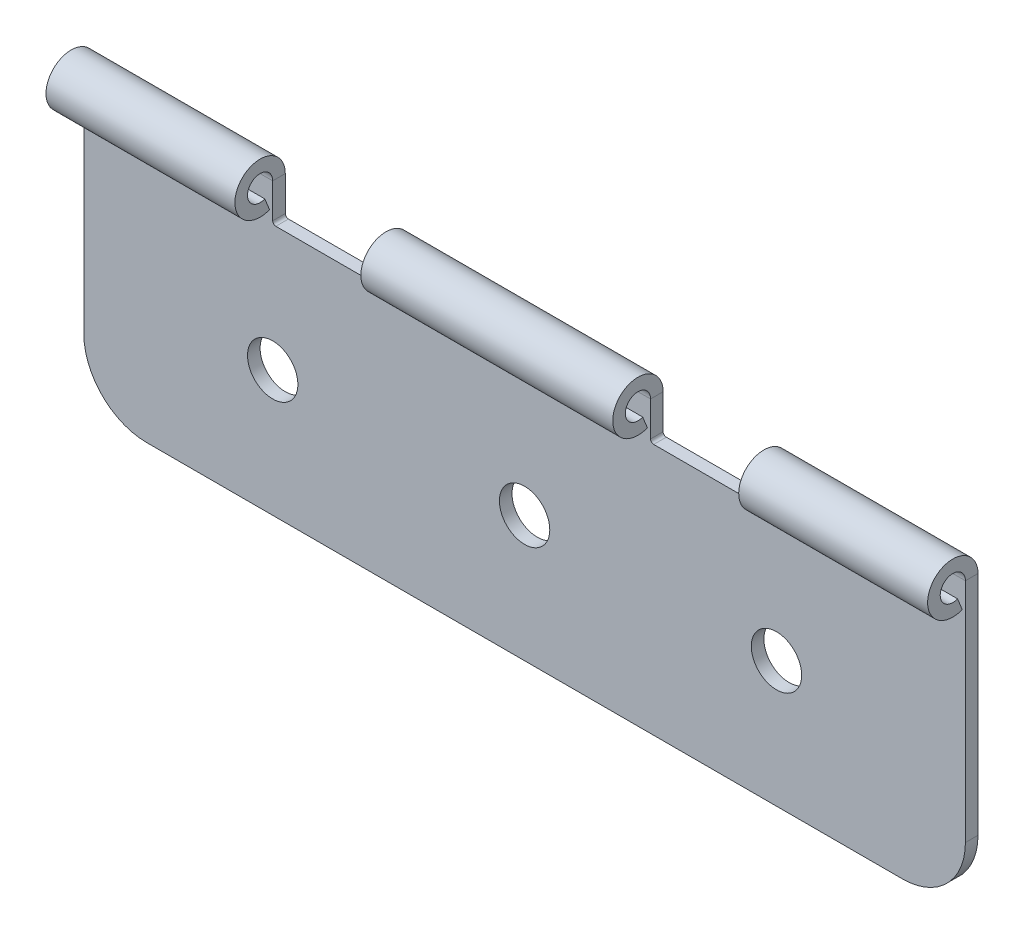
ISO-10303-21;
HEADER;
FILE_DESCRIPTION(('STEP AP214'),'2;1');
FILE_NAME('part.step','',(''),(''),'','','');
FILE_SCHEMA(('AUTOMOTIVE_DESIGN { 1 0 10303 214 1 1 1 1 }'));
ENDSEC;
DATA;
#1=APPLICATION_CONTEXT('core data for automotive mechanical design processes');
#2=APPLICATION_PROTOCOL_DEFINITION('international standard','automotive_design',2000,#1);
#3=PRODUCT_CONTEXT('',#1,'mechanical');
#4=PRODUCT('Part','Part','',(#3));
#5=PRODUCT_RELATED_PRODUCT_CATEGORY('part','',(#4));
#6=PRODUCT_DEFINITION_FORMATION('','',#4);
#7=PRODUCT_DEFINITION_CONTEXT('part definition',#1,'design');
#8=PRODUCT_DEFINITION('design','',#6,#7);
#9=PRODUCT_DEFINITION_SHAPE('','',#8);
#10=(LENGTH_UNIT() NAMED_UNIT(*) SI_UNIT(.MILLI.,.METRE.));
#11=(NAMED_UNIT(*) PLANE_ANGLE_UNIT() SI_UNIT($,.RADIAN.));
#12=(NAMED_UNIT(*) SI_UNIT($,.STERADIAN.) SOLID_ANGLE_UNIT());
#13=UNCERTAINTY_MEASURE_WITH_UNIT(LENGTH_MEASURE(1.E-05),#10,'distance_accuracy_value','');
#14=(GEOMETRIC_REPRESENTATION_CONTEXT(3) GLOBAL_UNCERTAINTY_ASSIGNED_CONTEXT((#13)) GLOBAL_UNIT_ASSIGNED_CONTEXT((#10,
#11,#12)) REPRESENTATION_CONTEXT('',''));
#15=CARTESIAN_POINT('',(0.,0.,0.));
#16=DIRECTION('',(0.,0.,1.));
#17=DIRECTION('',(1.,0.,0.));
#18=AXIS2_PLACEMENT_3D('',#15,#16,#17);
#19=CARTESIAN_POINT('',(0.,0.,-1.));
#20=DIRECTION('',(-1.,0.,0.));
#21=DIRECTION('',(0.,0.,1.));
#22=AXIS2_PLACEMENT_3D('',#19,#20,#21);
#23=PLANE('',#22);
#24=DIRECTION('',(0.,-1.,0.));
#25=VECTOR('',#24,1.);
#26=CARTESIAN_POINT('',(0.,0.,-1.));
#27=LINE('',#26,#25);
#28=CARTESIAN_POINT('',(0.,23.,-1.));
#29=VERTEX_POINT('',#28);
#30=CARTESIAN_POINT('',(0.,5.,-1.));
#31=VERTEX_POINT('',#30);
#32=EDGE_CURVE('E206',#29,#31,#27,.T.);
#33=ORIENTED_EDGE('',*,*,#32,.T.);
#34=DIRECTION('',(0.,0.,1.));
#35=VECTOR('',#34,1.);
#36=CARTESIAN_POINT('',(0.,5.,-1.));
#37=LINE('',#36,#35);
#38=CARTESIAN_POINT('',(0.,5.,0.));
#39=VERTEX_POINT('',#38);
#40=EDGE_CURVE('E398',#31,#39,#37,.T.);
#41=ORIENTED_EDGE('',*,*,#40,.T.);
#42=DIRECTION('',(0.,-1.,0.));
#43=VECTOR('',#42,1.);
#44=CARTESIAN_POINT('',(0.,0.,0.));
#45=LINE('',#44,#43);
#46=CARTESIAN_POINT('',(0.,23.,0.));
#47=VERTEX_POINT('',#46);
#48=EDGE_CURVE('E325',#47,#39,#45,.T.);
#49=ORIENTED_EDGE('',*,*,#48,.F.);
#50=DIRECTION('',(0.,0.,-1.));
#51=VECTOR('',#50,1.);
#52=CARTESIAN_POINT('',(0.,23.,0.));
#53=LINE('',#52,#51);
#54=EDGE_CURVE('E218',#47,#29,#53,.T.);
#55=ORIENTED_EDGE('',*,*,#54,.T.);
#56=EDGE_LOOP('',(#33,#41,#49,#55));
#57=FACE_BOUND('',#56,.T.);
#58=ADVANCED_FACE('F36',(#57),#23,.T.);
#59=CARTESIAN_POINT('',(55.,20.,-1.));
#60=DIRECTION('',(-1.,0.,0.));
#61=DIRECTION('',(0.,0.,1.));
#62=AXIS2_PLACEMENT_3D('',#59,#60,#61);
#63=PLANE('',#62);
#64=DIRECTION('',(0.,-1.,0.));
#65=VECTOR('',#64,1.);
#66=CARTESIAN_POINT('',(55.,20.,-1.));
#67=LINE('',#66,#65);
#68=CARTESIAN_POINT('',(55.,23.,-1.));
#69=VERTEX_POINT('',#68);
#70=CARTESIAN_POINT('',(55.,20.25,-1.));
#71=VERTEX_POINT('',#70);
#72=EDGE_CURVE('E327',#69,#71,#67,.T.);
#73=ORIENTED_EDGE('',*,*,#72,.T.);
#74=DIRECTION('',(0.,0.,1.));
#75=VECTOR('',#74,1.);
#76=CARTESIAN_POINT('',(55.,20.25,0.));
#77=LINE('',#76,#75);
#78=CARTESIAN_POINT('',(55.,20.25,0.));
#79=VERTEX_POINT('',#78);
#80=EDGE_CURVE('E341',#71,#79,#77,.T.);
#81=ORIENTED_EDGE('',*,*,#80,.T.);
#82=DIRECTION('',(0.,-1.,0.));
#83=VECTOR('',#82,1.);
#84=CARTESIAN_POINT('',(55.,20.,0.));
#85=LINE('',#84,#83);
#86=CARTESIAN_POINT('',(55.,23.,0.));
#87=VERTEX_POINT('',#86);
#88=EDGE_CURVE('E346',#87,#79,#85,.T.);
#89=ORIENTED_EDGE('',*,*,#88,.F.);
#90=DIRECTION('',(0.,0.,-1.));
#91=VECTOR('',#90,1.);
#92=CARTESIAN_POINT('',(55.,23.,0.));
#93=LINE('',#92,#91);
#94=EDGE_CURVE('E263',#87,#69,#93,.T.);
#95=ORIENTED_EDGE('',*,*,#94,.T.);
#96=EDGE_LOOP('',(#73,#81,#89,#95));
#97=FACE_BOUND('',#96,.T.);
#98=ADVANCED_FACE('F442',(#97),#63,.T.);
#99=CARTESIAN_POINT('',(25.,20.,-1.));
#100=DIRECTION('',(-1.,0.,0.));
#101=DIRECTION('',(0.,0.,1.));
#102=AXIS2_PLACEMENT_3D('',#99,#100,#101);
#103=PLANE('',#102);
#104=DIRECTION('',(0.,-1.,0.));
#105=VECTOR('',#104,1.);
#106=CARTESIAN_POINT('',(25.,20.,-1.));
#107=LINE('',#106,#105);
#108=CARTESIAN_POINT('',(25.,23.,-1.));
#109=VERTEX_POINT('',#108);
#110=CARTESIAN_POINT('',(25.,20.25,-1.));
#111=VERTEX_POINT('',#110);
#112=EDGE_CURVE('E335',#109,#111,#107,.T.);
#113=ORIENTED_EDGE('',*,*,#112,.T.);
#114=DIRECTION('',(0.,0.,1.));
#115=VECTOR('',#114,1.);
#116=CARTESIAN_POINT('',(25.,20.25,0.));
#117=LINE('',#116,#115);
#118=CARTESIAN_POINT('',(25.,20.25,0.));
#119=VERTEX_POINT('',#118);
#120=EDGE_CURVE('E373',#111,#119,#117,.T.);
#121=ORIENTED_EDGE('',*,*,#120,.T.);
#122=DIRECTION('',(0.,-1.,0.));
#123=VECTOR('',#122,1.);
#124=CARTESIAN_POINT('',(25.,20.,0.));
#125=LINE('',#124,#123);
#126=CARTESIAN_POINT('',(25.,23.,0.));
#127=VERTEX_POINT('',#126);
#128=EDGE_CURVE('E354',#127,#119,#125,.T.);
#129=ORIENTED_EDGE('',*,*,#128,.F.);
#130=DIRECTION('',(0.,0.,-1.));
#131=VECTOR('',#130,1.);
#132=CARTESIAN_POINT('',(25.,23.,0.));
#133=LINE('',#132,#131);
#134=EDGE_CURVE('E296',#127,#109,#133,.T.);
#135=ORIENTED_EDGE('',*,*,#134,.T.);
#136=EDGE_LOOP('',(#113,#121,#129,#135));
#137=FACE_BOUND('',#136,.T.);
#138=ADVANCED_FACE('F475',(#137),#103,.T.);
#139=CARTESIAN_POINT('',(70.,0.,-1.));
#140=DIRECTION('',(0.,-1.,0.));
#141=DIRECTION('',(1.,0.,0.));
#142=AXIS2_PLACEMENT_3D('',#139,#140,#141);
#143=PLANE('',#142);
#144=DIRECTION('',(1.,0.,0.));
#145=VECTOR('',#144,1.);
#146=CARTESIAN_POINT('',(70.,0.,0.));
#147=LINE('',#146,#145);
#148=CARTESIAN_POINT('',(5.,0.,0.));
#149=VERTEX_POINT('',#148);
#150=CARTESIAN_POINT('',(65.,0.,0.));
#151=VERTEX_POINT('',#150);
#152=EDGE_CURVE('E319',#149,#151,#147,.T.);
#153=ORIENTED_EDGE('',*,*,#152,.F.);
#154=DIRECTION('',(0.,0.,1.));
#155=VECTOR('',#154,1.);
#156=CARTESIAN_POINT('',(5.,0.,-1.));
#157=LINE('',#156,#155);
#158=CARTESIAN_POINT('',(5.,0.,-1.));
#159=VERTEX_POINT('',#158);
#160=EDGE_CURVE('E408',#149,#159,#157,.F.);
#161=ORIENTED_EDGE('',*,*,#160,.T.);
#162=DIRECTION('',(1.,0.,0.));
#163=VECTOR('',#162,1.);
#164=CARTESIAN_POINT('',(70.,0.,-1.));
#165=LINE('',#164,#163);
#166=CARTESIAN_POINT('',(65.,0.,-1.));
#167=VERTEX_POINT('',#166);
#168=EDGE_CURVE('E322',#159,#167,#165,.T.);
#169=ORIENTED_EDGE('',*,*,#168,.T.);
#170=DIRECTION('',(0.,0.,1.));
#171=VECTOR('',#170,1.);
#172=CARTESIAN_POINT('',(65.,0.,-1.));
#173=LINE('',#172,#171);
#174=EDGE_CURVE('E405',#167,#151,#173,.T.);
#175=ORIENTED_EDGE('',*,*,#174,.T.);
#176=EDGE_LOOP('',(#153,#161,#169,#175));
#177=FACE_BOUND('',#176,.T.);
#178=ADVANCED_FACE('F423',(#177),#143,.T.);
#179=CARTESIAN_POINT('',(15.,25.,-1.));
#180=DIRECTION('',(1.,0.,0.));
#181=DIRECTION('',(0.,0.,-1.));
#182=AXIS2_PLACEMENT_3D('',#179,#180,#181);
#183=PLANE('',#182);
#184=DIRECTION('',(0.,1.,0.));
#185=VECTOR('',#184,1.);
#186=CARTESIAN_POINT('',(15.,25.,0.));
#187=LINE('',#186,#185);
#188=CARTESIAN_POINT('',(15.,20.25,0.));
#189=VERTEX_POINT('',#188);
#190=CARTESIAN_POINT('',(15.,23.,0.));
#191=VERTEX_POINT('',#190);
#192=EDGE_CURVE('E360',#189,#191,#187,.T.);
#193=ORIENTED_EDGE('',*,*,#192,.F.);
#194=DIRECTION('',(0.,0.,1.));
#195=VECTOR('',#194,1.);
#196=CARTESIAN_POINT('',(15.,20.25,-1.));
#197=LINE('',#196,#195);
#198=CARTESIAN_POINT('',(15.,20.25,-1.));
#199=VERTEX_POINT('',#198);
#200=EDGE_CURVE('E203',#189,#199,#197,.F.);
#201=ORIENTED_EDGE('',*,*,#200,.T.);
#202=DIRECTION('',(0.,1.,0.));
#203=VECTOR('',#202,1.);
#204=CARTESIAN_POINT('',(15.,25.,-1.));
#205=LINE('',#204,#203);
#206=CARTESIAN_POINT('',(15.,23.,-1.));
#207=VERTEX_POINT('',#206);
#208=EDGE_CURVE('E197',#199,#207,#205,.T.);
#209=ORIENTED_EDGE('',*,*,#208,.T.);
#210=DIRECTION('',(0.,0.,-1.));
#211=VECTOR('',#210,1.);
#212=CARTESIAN_POINT('',(15.,23.,0.));
#213=LINE('',#212,#211);
#214=EDGE_CURVE('E201',#191,#207,#213,.T.);
#215=ORIENTED_EDGE('',*,*,#214,.F.);
#216=EDGE_LOOP('',(#193,#201,#209,#215));
#217=FACE_BOUND('',#216,.T.);
#218=ADVANCED_FACE('F200',(#217),#183,.T.);
#219=CARTESIAN_POINT('',(15.,20.,-1.));
#220=DIRECTION('',(0.,1.,0.));
#221=DIRECTION('',(-1.,0.,0.));
#222=AXIS2_PLACEMENT_3D('',#219,#220,#221);
#223=PLANE('',#222);
#224=DIRECTION('',(-1.,0.,0.));
#225=VECTOR('',#224,1.);
#226=CARTESIAN_POINT('',(15.,20.,0.));
#227=LINE('',#226,#225);
#228=CARTESIAN_POINT('',(24.75,20.,0.));
#229=VERTEX_POINT('',#228);
#230=CARTESIAN_POINT('',(15.25,20.,0.));
#231=VERTEX_POINT('',#230);
#232=EDGE_CURVE('E357',#229,#231,#227,.T.);
#233=ORIENTED_EDGE('',*,*,#232,.F.);
#234=DIRECTION('',(0.,0.,1.));
#235=VECTOR('',#234,1.);
#236=CARTESIAN_POINT('',(24.75,20.,-1.));
#237=LINE('',#236,#235);
#238=CARTESIAN_POINT('',(24.75,20.,-1.));
#239=VERTEX_POINT('',#238);
#240=EDGE_CURVE('E379',#229,#239,#237,.F.);
#241=ORIENTED_EDGE('',*,*,#240,.T.);
#242=DIRECTION('',(-1.,0.,0.));
#243=VECTOR('',#242,1.);
#244=CARTESIAN_POINT('',(15.,20.,-1.));
#245=LINE('',#244,#243);
#246=CARTESIAN_POINT('',(15.25,20.,-1.));
#247=VERTEX_POINT('',#246);
#248=EDGE_CURVE('E207',#239,#247,#245,.T.);
#249=ORIENTED_EDGE('',*,*,#248,.T.);
#250=DIRECTION('',(0.,0.,1.));
#251=VECTOR('',#250,1.);
#252=CARTESIAN_POINT('',(15.25,20.,0.));
#253=LINE('',#252,#251);
#254=EDGE_CURVE('E376',#247,#231,#253,.T.);
#255=ORIENTED_EDGE('',*,*,#254,.T.);
#256=EDGE_LOOP('',(#233,#241,#249,#255));
#257=FACE_BOUND('',#256,.T.);
#258=ADVANCED_FACE('F483',(#257),#223,.T.);
#259=CARTESIAN_POINT('',(45.,25.,-1.));
#260=DIRECTION('',(1.,0.,0.));
#261=DIRECTION('',(0.,0.,-1.));
#262=AXIS2_PLACEMENT_3D('',#259,#260,#261);
#263=PLANE('',#262);
#264=DIRECTION('',(0.,1.,0.));
#265=VECTOR('',#264,1.);
#266=CARTESIAN_POINT('',(45.,25.,0.));
#267=LINE('',#266,#265);
#268=CARTESIAN_POINT('',(45.,20.25,0.));
#269=VERTEX_POINT('',#268);
#270=CARTESIAN_POINT('',(45.,23.,0.));
#271=VERTEX_POINT('',#270);
#272=EDGE_CURVE('E352',#269,#271,#267,.T.);
#273=ORIENTED_EDGE('',*,*,#272,.F.);
#274=DIRECTION('',(0.,0.,1.));
#275=VECTOR('',#274,1.);
#276=CARTESIAN_POINT('',(45.,20.25,-1.));
#277=LINE('',#276,#275);
#278=CARTESIAN_POINT('',(45.,20.25,-1.));
#279=VERTEX_POINT('',#278);
#280=EDGE_CURVE('E371',#269,#279,#277,.F.);
#281=ORIENTED_EDGE('',*,*,#280,.T.);
#282=DIRECTION('',(0.,1.,0.));
#283=VECTOR('',#282,1.);
#284=CARTESIAN_POINT('',(45.,25.,-1.));
#285=LINE('',#284,#283);
#286=CARTESIAN_POINT('',(45.,23.,-1.));
#287=VERTEX_POINT('',#286);
#288=EDGE_CURVE('E333',#279,#287,#285,.T.);
#289=ORIENTED_EDGE('',*,*,#288,.T.);
#290=DIRECTION('',(0.,0.,-1.));
#291=VECTOR('',#290,1.);
#292=CARTESIAN_POINT('',(45.,23.,0.));
#293=LINE('',#292,#291);
#294=EDGE_CURVE('E312',#271,#287,#293,.T.);
#295=ORIENTED_EDGE('',*,*,#294,.F.);
#296=EDGE_LOOP('',(#273,#281,#289,#295));
#297=FACE_BOUND('',#296,.T.);
#298=ADVANCED_FACE('F460',(#297),#263,.T.);
#299=CARTESIAN_POINT('',(45.,20.,-1.));
#300=DIRECTION('',(0.,1.,0.));
#301=DIRECTION('',(0.,0.,1.));
#302=AXIS2_PLACEMENT_3D('',#299,#300,#301);
#303=PLANE('',#302);
#304=DIRECTION('',(-1.,0.,0.));
#305=VECTOR('',#304,1.);
#306=CARTESIAN_POINT('',(45.,20.,0.));
#307=LINE('',#306,#305);
#308=CARTESIAN_POINT('',(54.75,20.,0.));
#309=VERTEX_POINT('',#308);
#310=CARTESIAN_POINT('',(45.25,20.,0.));
#311=VERTEX_POINT('',#310);
#312=EDGE_CURVE('E349',#309,#311,#307,.T.);
#313=ORIENTED_EDGE('',*,*,#312,.F.);
#314=DIRECTION('',(0.,0.,1.));
#315=VECTOR('',#314,1.);
#316=CARTESIAN_POINT('',(54.75,20.,-1.));
#317=LINE('',#316,#315);
#318=CARTESIAN_POINT('',(54.75,20.,-1.));
#319=VERTEX_POINT('',#318);
#320=EDGE_CURVE('E369',#309,#319,#317,.F.);
#321=ORIENTED_EDGE('',*,*,#320,.T.);
#322=DIRECTION('',(-1.,0.,0.));
#323=VECTOR('',#322,1.);
#324=CARTESIAN_POINT('',(45.,20.,-1.));
#325=LINE('',#324,#323);
#326=CARTESIAN_POINT('',(45.25,20.,-1.));
#327=VERTEX_POINT('',#326);
#328=EDGE_CURVE('E330',#319,#327,#325,.T.);
#329=ORIENTED_EDGE('',*,*,#328,.T.);
#330=DIRECTION('',(0.,0.,1.));
#331=VECTOR('',#330,1.);
#332=CARTESIAN_POINT('',(45.25,20.,0.));
#333=LINE('',#332,#331);
#334=EDGE_CURVE('E366',#327,#311,#333,.T.);
#335=ORIENTED_EDGE('',*,*,#334,.T.);
#336=EDGE_LOOP('',(#313,#321,#329,#335));
#337=FACE_BOUND('',#336,.T.);
#338=ADVANCED_FACE('F450',(#337),#303,.T.);
#339=CARTESIAN_POINT('',(70.,25.,-1.));
#340=DIRECTION('',(1.,0.,0.));
#341=DIRECTION('',(0.,0.,-1.));
#342=AXIS2_PLACEMENT_3D('',#339,#340,#341);
#343=PLANE('',#342);
#344=DIRECTION('',(0.,1.,0.));
#345=VECTOR('',#344,1.);
#346=CARTESIAN_POINT('',(70.,25.,0.));
#347=LINE('',#346,#345);
#348=CARTESIAN_POINT('',(70.,5.00000000000001,0.));
#349=VERTEX_POINT('',#348);
#350=CARTESIAN_POINT('',(70.,23.,0.));
#351=VERTEX_POINT('',#350);
#352=EDGE_CURVE('E344',#349,#351,#347,.T.);
#353=ORIENTED_EDGE('',*,*,#352,.F.);
#354=DIRECTION('',(0.,0.,1.));
#355=VECTOR('',#354,1.);
#356=CARTESIAN_POINT('',(70.,5.,-1.));
#357=LINE('',#356,#355);
#358=CARTESIAN_POINT('',(70.,5.00000000000001,-1.));
#359=VERTEX_POINT('',#358);
#360=EDGE_CURVE('E11',#349,#359,#357,.F.);
#361=ORIENTED_EDGE('',*,*,#360,.T.);
#362=DIRECTION('',(0.,1.,0.));
#363=VECTOR('',#362,1.);
#364=CARTESIAN_POINT('',(70.,25.,-1.));
#365=LINE('',#364,#363);
#366=CARTESIAN_POINT('',(70.,23.,-1.));
#367=VERTEX_POINT('',#366);
#368=EDGE_CURVE('E324',#359,#367,#365,.T.);
#369=ORIENTED_EDGE('',*,*,#368,.T.);
#370=DIRECTION('',(0.,0.,-1.));
#371=VECTOR('',#370,1.);
#372=CARTESIAN_POINT('',(70.,23.,0.));
#373=LINE('',#372,#371);
#374=EDGE_CURVE('E279',#351,#367,#373,.T.);
#375=ORIENTED_EDGE('',*,*,#374,.F.);
#376=EDGE_LOOP('',(#353,#361,#369,#375));
#377=FACE_BOUND('',#376,.T.);
#378=ADVANCED_FACE('F428',(#377),#343,.T.);
#379=CARTESIAN_POINT('',(0.,0.,-1.));
#380=DIRECTION('',(0.,0.,-1.));
#381=DIRECTION('',(-1.,0.,0.));
#382=AXIS2_PLACEMENT_3D('',#379,#380,#381);
#383=PLANE('',#382);
#384=CARTESIAN_POINT('',(55.,10.,-0.999999999999999));
#385=DIRECTION('',(0.,0.,-1.));
#386=DIRECTION('',(-1.,0.,0.));
#387=AXIS2_PLACEMENT_3D('',#384,#385,#386);
#388=CIRCLE('',#387,2.);
#389=CARTESIAN_POINT('',(53.,10.,-0.999999999999999));
#390=VERTEX_POINT('',#389);
#391=EDGE_CURVE('E865',#390,#390,#388,.T.);
#392=ORIENTED_EDGE('',*,*,#391,.F.);
#393=EDGE_LOOP('',(#392));
#394=FACE_BOUND('',#393,.T.);
#395=CARTESIAN_POINT('',(15.,10.,-0.999999999999999));
#396=DIRECTION('',(0.,0.,-1.));
#397=DIRECTION('',(-1.,0.,0.));
#398=AXIS2_PLACEMENT_3D('',#395,#396,#397);
#399=CIRCLE('',#398,2.);
#400=CARTESIAN_POINT('',(13.,10.,-0.999999999999999));
#401=VERTEX_POINT('',#400);
#402=EDGE_CURVE('E859',#401,#401,#399,.T.);
#403=ORIENTED_EDGE('',*,*,#402,.F.);
#404=EDGE_LOOP('',(#403));
#405=FACE_BOUND('',#404,.T.);
#406=CARTESIAN_POINT('',(35.,10.,-1.));
#407=DIRECTION('',(0.,0.,1.));
#408=DIRECTION('',(1.,0.,0.));
#409=AXIS2_PLACEMENT_3D('',#406,#407,#408);
#410=CIRCLE('',#409,2.);
#411=CARTESIAN_POINT('',(37.,10.,-1.));
#412=VERTEX_POINT('',#411);
#413=EDGE_CURVE('E248',#412,#412,#410,.T.);
#414=ORIENTED_EDGE('',*,*,#413,.T.);
#415=EDGE_LOOP('',(#414));
#416=FACE_BOUND('',#415,.T.);
#417=ORIENTED_EDGE('',*,*,#168,.F.);
#418=CARTESIAN_POINT('',(5.,5.,-1.));
#419=DIRECTION('',(0.,0.,-1.));
#420=DIRECTION('',(-1.,0.,0.));
#421=AXIS2_PLACEMENT_3D('',#418,#419,#420);
#422=CIRCLE('',#421,5.);
#423=EDGE_CURVE('E44',#159,#31,#422,.T.);
#424=ORIENTED_EDGE('',*,*,#423,.T.);
#425=ORIENTED_EDGE('',*,*,#32,.F.);
#426=DIRECTION('',(-1.,0.,0.));
#427=VECTOR('',#426,1.);
#428=CARTESIAN_POINT('',(0.,23.,-1.));
#429=LINE('',#428,#427);
#430=EDGE_CURVE('E224',#29,#207,#429,.F.);
#431=ORIENTED_EDGE('',*,*,#430,.T.);
#432=ORIENTED_EDGE('',*,*,#208,.F.);
#433=CARTESIAN_POINT('',(15.25,20.25,-1.));
#434=DIRECTION('',(0.,0.,-1.));
#435=DIRECTION('',(-1.,0.,0.));
#436=AXIS2_PLACEMENT_3D('',#433,#434,#435);
#437=CIRCLE('',#436,0.25);
#438=EDGE_CURVE('E396',#199,#247,#437,.F.);
#439=ORIENTED_EDGE('',*,*,#438,.T.);
#440=ORIENTED_EDGE('',*,*,#248,.F.);
#441=CARTESIAN_POINT('',(24.75,20.25,-1.));
#442=DIRECTION('',(0.,0.,-1.));
#443=DIRECTION('',(-1.,0.,0.));
#444=AXIS2_PLACEMENT_3D('',#441,#442,#443);
#445=CIRCLE('',#444,0.25);
#446=EDGE_CURVE('E392',#239,#111,#445,.F.);
#447=ORIENTED_EDGE('',*,*,#446,.T.);
#448=ORIENTED_EDGE('',*,*,#112,.F.);
#449=DIRECTION('',(-1.,0.,0.));
#450=VECTOR('',#449,1.);
#451=CARTESIAN_POINT('',(25.,23.,-1.));
#452=LINE('',#451,#450);
#453=EDGE_CURVE('E289',#109,#287,#452,.F.);
#454=ORIENTED_EDGE('',*,*,#453,.T.);
#455=ORIENTED_EDGE('',*,*,#288,.F.);
#456=CARTESIAN_POINT('',(45.25,20.25,-1.));
#457=DIRECTION('',(0.,0.,-1.));
#458=DIRECTION('',(-1.,0.,0.));
#459=AXIS2_PLACEMENT_3D('',#456,#457,#458);
#460=CIRCLE('',#459,0.25);
#461=EDGE_CURVE('E388',#279,#327,#460,.F.);
#462=ORIENTED_EDGE('',*,*,#461,.T.);
#463=ORIENTED_EDGE('',*,*,#328,.F.);
#464=CARTESIAN_POINT('',(54.75,20.25,-1.));
#465=DIRECTION('',(0.,0.,-1.));
#466=DIRECTION('',(-1.,0.,0.));
#467=AXIS2_PLACEMENT_3D('',#464,#465,#466);
#468=CIRCLE('',#467,0.25);
#469=EDGE_CURVE('E384',#319,#71,#468,.F.);
#470=ORIENTED_EDGE('',*,*,#469,.T.);
#471=ORIENTED_EDGE('',*,*,#72,.F.);
#472=DIRECTION('',(-1.,0.,0.));
#473=VECTOR('',#472,1.);
#474=CARTESIAN_POINT('',(55.,23.,-1.));
#475=LINE('',#474,#473);
#476=EDGE_CURVE('E256',#69,#367,#475,.F.);
#477=ORIENTED_EDGE('',*,*,#476,.T.);
#478=ORIENTED_EDGE('',*,*,#368,.F.);
#479=CARTESIAN_POINT('',(65.,5.,-1.));
#480=DIRECTION('',(0.,0.,-1.));
#481=DIRECTION('',(-1.,0.,0.));
#482=AXIS2_PLACEMENT_3D('',#479,#480,#481);
#483=CIRCLE('',#482,5.);
#484=EDGE_CURVE('E56',#359,#167,#483,.T.);
#485=ORIENTED_EDGE('',*,*,#484,.T.);
#486=EDGE_LOOP('',(#417,#424,#425,#431,#432,#439,#440,#447,#448,#454,#455,#462,#463,#470,#471,
#477,#478,#485));
#487=FACE_BOUND('',#486,.T.);
#488=ADVANCED_FACE('F230',(#394,#405,#416,#487),#383,.T.);
#489=CARTESIAN_POINT('',(0.,0.,0.));
#490=DIRECTION('',(0.,0.,-1.));
#491=DIRECTION('',(-1.,0.,0.));
#492=AXIS2_PLACEMENT_3D('',#489,#490,#491);
#493=PLANE('',#492);
#494=CARTESIAN_POINT('',(55.,10.,0.));
#495=DIRECTION('',(0.,0.,1.));
#496=DIRECTION('',(1.,0.,0.));
#497=AXIS2_PLACEMENT_3D('',#494,#495,#496);
#498=CIRCLE('',#497,2.);
#499=CARTESIAN_POINT('',(57.,10.,0.));
#500=VERTEX_POINT('',#499);
#501=EDGE_CURVE('E870',#500,#500,#498,.T.);
#502=ORIENTED_EDGE('',*,*,#501,.F.);
#503=EDGE_LOOP('',(#502));
#504=FACE_BOUND('',#503,.T.);
#505=CARTESIAN_POINT('',(15.,10.,0.));
#506=DIRECTION('',(0.,0.,1.));
#507=DIRECTION('',(1.,0.,0.));
#508=AXIS2_PLACEMENT_3D('',#505,#506,#507);
#509=CIRCLE('',#508,2.);
#510=CARTESIAN_POINT('',(17.,10.,0.));
#511=VERTEX_POINT('',#510);
#512=EDGE_CURVE('E861',#511,#511,#509,.T.);
#513=ORIENTED_EDGE('',*,*,#512,.F.);
#514=EDGE_LOOP('',(#513));
#515=FACE_BOUND('',#514,.T.);
#516=CARTESIAN_POINT('',(35.,10.,0.));
#517=DIRECTION('',(0.,0.,1.));
#518=DIRECTION('',(1.,0.,0.));
#519=AXIS2_PLACEMENT_3D('',#516,#517,#518);
#520=CIRCLE('',#519,2.);
#521=CARTESIAN_POINT('',(37.,10.,0.));
#522=VERTEX_POINT('',#521);
#523=EDGE_CURVE('E236',#522,#522,#520,.T.);
#524=ORIENTED_EDGE('',*,*,#523,.F.);
#525=EDGE_LOOP('',(#524));
#526=FACE_BOUND('',#525,.T.);
#527=ORIENTED_EDGE('',*,*,#48,.T.);
#528=CARTESIAN_POINT('',(5.,5.,0.));
#529=DIRECTION('',(0.,0.,-1.));
#530=DIRECTION('',(-1.,0.,0.));
#531=AXIS2_PLACEMENT_3D('',#528,#529,#530);
#532=CIRCLE('',#531,5.);
#533=EDGE_CURVE('E403',#39,#149,#532,.F.);
#534=ORIENTED_EDGE('',*,*,#533,.T.);
#535=ORIENTED_EDGE('',*,*,#152,.T.);
#536=CARTESIAN_POINT('',(65.,5.,0.));
#537=DIRECTION('',(0.,0.,-1.));
#538=DIRECTION('',(-1.,0.,0.));
#539=AXIS2_PLACEMENT_3D('',#536,#537,#538);
#540=CIRCLE('',#539,5.);
#541=EDGE_CURVE('E401',#151,#349,#540,.F.);
#542=ORIENTED_EDGE('',*,*,#541,.T.);
#543=ORIENTED_EDGE('',*,*,#352,.T.);
#544=DIRECTION('',(-1.,0.,0.));
#545=VECTOR('',#544,1.);
#546=CARTESIAN_POINT('',(55.,23.,0.));
#547=LINE('',#546,#545);
#548=EDGE_CURVE('E272',#87,#351,#547,.F.);
#549=ORIENTED_EDGE('',*,*,#548,.F.);
#550=ORIENTED_EDGE('',*,*,#88,.T.);
#551=CARTESIAN_POINT('',(54.75,20.25,0.));
#552=DIRECTION('',(0.,0.,-1.));
#553=DIRECTION('',(-1.,0.,0.));
#554=AXIS2_PLACEMENT_3D('',#551,#552,#553);
#555=CIRCLE('',#554,0.25);
#556=EDGE_CURVE('E382',#79,#309,#555,.T.);
#557=ORIENTED_EDGE('',*,*,#556,.T.);
#558=ORIENTED_EDGE('',*,*,#312,.T.);
#559=CARTESIAN_POINT('',(45.25,20.25,0.));
#560=DIRECTION('',(0.,0.,-1.));
#561=DIRECTION('',(-1.,0.,0.));
#562=AXIS2_PLACEMENT_3D('',#559,#560,#561);
#563=CIRCLE('',#562,0.25);
#564=EDGE_CURVE('E386',#311,#269,#563,.T.);
#565=ORIENTED_EDGE('',*,*,#564,.T.);
#566=ORIENTED_EDGE('',*,*,#272,.T.);
#567=DIRECTION('',(-1.,0.,0.));
#568=VECTOR('',#567,1.);
#569=CARTESIAN_POINT('',(25.,23.,0.));
#570=LINE('',#569,#568);
#571=EDGE_CURVE('E305',#127,#271,#570,.F.);
#572=ORIENTED_EDGE('',*,*,#571,.F.);
#573=ORIENTED_EDGE('',*,*,#128,.T.);
#574=CARTESIAN_POINT('',(24.75,20.25,0.));
#575=DIRECTION('',(0.,0.,-1.));
#576=DIRECTION('',(-1.,0.,0.));
#577=AXIS2_PLACEMENT_3D('',#574,#575,#576);
#578=CIRCLE('',#577,0.25);
#579=EDGE_CURVE('E390',#119,#229,#578,.T.);
#580=ORIENTED_EDGE('',*,*,#579,.T.);
#581=ORIENTED_EDGE('',*,*,#232,.T.);
#582=CARTESIAN_POINT('',(15.25,20.25,0.));
#583=DIRECTION('',(0.,0.,-1.));
#584=DIRECTION('',(-1.,0.,0.));
#585=AXIS2_PLACEMENT_3D('',#582,#583,#584);
#586=CIRCLE('',#585,0.25);
#587=EDGE_CURVE('E394',#231,#189,#586,.T.);
#588=ORIENTED_EDGE('',*,*,#587,.T.);
#589=ORIENTED_EDGE('',*,*,#192,.T.);
#590=DIRECTION('',(-1.,0.,0.));
#591=VECTOR('',#590,1.);
#592=CARTESIAN_POINT('',(0.,23.,0.));
#593=LINE('',#592,#591);
#594=EDGE_CURVE('E241',#47,#191,#593,.F.);
#595=ORIENTED_EDGE('',*,*,#594,.F.);
#596=EDGE_LOOP('',(#527,#534,#535,#542,#543,#549,#550,#557,#558,#565,#566,#572,#573,#580,#581,
#588,#589,#595));
#597=FACE_BOUND('',#596,.T.);
#598=ADVANCED_FACE('F420',(#504,#515,#526,#597),#493,.F.);
#599=CARTESIAN_POINT('',(35.,22.0728161454332,0.625393406584076));
#600=DIRECTION('',(0.,-0.374606593415923,0.927183854566783));
#601=DIRECTION('',(-1.,0.,0.));
#602=AXIS2_PLACEMENT_3D('',#599,#600,#601);
#603=PLANE('',#602);
#604=DIRECTION('',(0.,-0.927183854566783,-0.374606593415923));
#605=VECTOR('',#604,1.);
#606=CARTESIAN_POINT('',(25.,22.0728161454332,0.625393406584075));
#607=LINE('',#606,#605);
#608=CARTESIAN_POINT('',(25.,22.0728161454332,0.625393406584075));
#609=VERTEX_POINT('',#608);
#610=CARTESIAN_POINT('',(25.,21.1456322908664,0.250786813168152));
#611=VERTEX_POINT('',#610);
#612=EDGE_CURVE('E317',#609,#611,#607,.T.);
#613=ORIENTED_EDGE('',*,*,#612,.F.);
#614=DIRECTION('',(-1.,0.,0.));
#615=VECTOR('',#614,1.);
#616=CARTESIAN_POINT('',(25.,22.0728161454332,0.625393406584075));
#617=LINE('',#616,#615);
#618=CARTESIAN_POINT('',(45.,22.0728161454332,0.625393406584077));
#619=VERTEX_POINT('',#618);
#620=EDGE_CURVE('E286',#619,#609,#617,.T.);
#621=ORIENTED_EDGE('',*,*,#620,.F.);
#622=DIRECTION('',(0.,-0.927183854566783,-0.374606593415923));
#623=VECTOR('',#622,1.);
#624=CARTESIAN_POINT('',(45.,22.0728161454332,0.625393406584077));
#625=LINE('',#624,#623);
#626=CARTESIAN_POINT('',(45.,21.1456322908664,0.250786813168154));
#627=VERTEX_POINT('',#626);
#628=EDGE_CURVE('E315',#619,#627,#625,.T.);
#629=ORIENTED_EDGE('',*,*,#628,.T.);
#630=DIRECTION('',(-1.,0.,0.));
#631=VECTOR('',#630,1.);
#632=CARTESIAN_POINT('',(25.,21.1456322908664,0.250786813168152));
#633=LINE('',#632,#631);
#634=EDGE_CURVE('E297',#627,#611,#633,.T.);
#635=ORIENTED_EDGE('',*,*,#634,.T.);
#636=EDGE_LOOP('',(#613,#621,#629,#635));
#637=FACE_BOUND('',#636,.T.);
#638=ADVANCED_FACE('F559',(#637),#603,.F.);
#639=CARTESIAN_POINT('',(45.,23.,1.));
#640=DIRECTION('',(1.,0.,0.));
#641=DIRECTION('',(0.,0.,-1.));
#642=AXIS2_PLACEMENT_3D('',#639,#640,#641);
#643=PLANE('',#642);
#644=ORIENTED_EDGE('',*,*,#628,.F.);
#645=CARTESIAN_POINT('',(45.,23.,1.));
#646=DIRECTION('',(-1.,0.,0.));
#647=DIRECTION('',(0.,0.,1.));
#648=AXIS2_PLACEMENT_3D('',#645,#646,#647);
#649=CIRCLE('',#648,1.);
#650=EDGE_CURVE('E300',#271,#619,#649,.F.);
#651=ORIENTED_EDGE('',*,*,#650,.F.);
#652=ORIENTED_EDGE('',*,*,#294,.T.);
#653=CARTESIAN_POINT('',(45.,23.,1.));
#654=DIRECTION('',(-1.,0.,0.));
#655=DIRECTION('',(0.,0.,1.));
#656=AXIS2_PLACEMENT_3D('',#653,#654,#655);
#657=CIRCLE('',#656,2.);
#658=EDGE_CURVE('E292',#287,#627,#657,.F.);
#659=ORIENTED_EDGE('',*,*,#658,.T.);
#660=EDGE_LOOP('',(#644,#651,#652,#659));
#661=FACE_BOUND('',#660,.T.);
#662=ADVANCED_FACE('F465',(#661),#643,.T.);
#663=CARTESIAN_POINT('',(25.,23.,0.999999999999999));
#664=DIRECTION('',(1.,0.,0.));
#665=DIRECTION('',(0.,0.,-1.));
#666=AXIS2_PLACEMENT_3D('',#663,#664,#665);
#667=PLANE('',#666);
#668=CARTESIAN_POINT('',(25.,23.,0.999999999999999));
#669=DIRECTION('',(-1.,0.,0.));
#670=DIRECTION('',(0.,0.,1.));
#671=AXIS2_PLACEMENT_3D('',#668,#669,#670);
#672=CIRCLE('',#671,1.);
#673=EDGE_CURVE('E308',#609,#127,#672,.T.);
#674=ORIENTED_EDGE('',*,*,#673,.F.);
#675=ORIENTED_EDGE('',*,*,#612,.T.);
#676=CARTESIAN_POINT('',(25.,23.,0.999999999999999));
#677=DIRECTION('',(-1.,0.,0.));
#678=DIRECTION('',(0.,0.,1.));
#679=AXIS2_PLACEMENT_3D('',#676,#677,#678);
#680=CIRCLE('',#679,2.);
#681=EDGE_CURVE('E293',#611,#109,#680,.T.);
#682=ORIENTED_EDGE('',*,*,#681,.T.);
#683=ORIENTED_EDGE('',*,*,#134,.F.);
#684=EDGE_LOOP('',(#674,#675,#682,#683));
#685=FACE_BOUND('',#684,.T.);
#686=ADVANCED_FACE('F790',(#685),#667,.F.);
#687=CARTESIAN_POINT('',(25.,23.,0.999999999999999));
#688=DIRECTION('',(-1.,0.,0.));
#689=DIRECTION('',(0.,-0.927183854566783,-0.374606593415923));
#690=AXIS2_PLACEMENT_3D('',#687,#688,#689);
#691=CYLINDRICAL_SURFACE('',#690,2.);
#692=ORIENTED_EDGE('',*,*,#453,.F.);
#693=ORIENTED_EDGE('',*,*,#681,.F.);
#694=ORIENTED_EDGE('',*,*,#634,.F.);
#695=ORIENTED_EDGE('',*,*,#658,.F.);
#696=EDGE_LOOP('',(#692,#693,#694,#695));
#697=FACE_BOUND('',#696,.T.);
#698=ADVANCED_FACE('F468',(#697),#691,.T.);
#699=CARTESIAN_POINT('',(25.,23.,0.999999999999999));
#700=DIRECTION('',(-1.,0.,0.));
#701=DIRECTION('',(0.,-0.927183854566783,-0.374606593415923));
#702=AXIS2_PLACEMENT_3D('',#699,#700,#701);
#703=CYLINDRICAL_SURFACE('',#702,1.);
#704=ORIENTED_EDGE('',*,*,#571,.T.);
#705=ORIENTED_EDGE('',*,*,#650,.T.);
#706=ORIENTED_EDGE('',*,*,#620,.T.);
#707=ORIENTED_EDGE('',*,*,#673,.T.);
#708=EDGE_LOOP('',(#704,#705,#706,#707));
#709=FACE_BOUND('',#708,.T.);
#710=ADVANCED_FACE('F771',(#709),#703,.F.);
#711=CARTESIAN_POINT('',(62.5,22.0728161454332,0.625393406584076));
#712=DIRECTION('',(0.,-0.374606593415923,0.927183854566783));
#713=DIRECTION('',(-1.,0.,0.));
#714=AXIS2_PLACEMENT_3D('',#711,#712,#713);
#715=PLANE('',#714);
#716=DIRECTION('',(0.,-0.927183854566783,-0.374606593415923));
#717=VECTOR('',#716,1.);
#718=CARTESIAN_POINT('',(55.,22.0728161454332,0.625393406584076));
#719=LINE('',#718,#717);
#720=CARTESIAN_POINT('',(55.,22.0728161454332,0.625393406584076));
#721=VERTEX_POINT('',#720);
#722=CARTESIAN_POINT('',(55.,21.1456322908664,0.250786813168153));
#723=VERTEX_POINT('',#722);
#724=EDGE_CURVE('E284',#721,#723,#719,.T.);
#725=ORIENTED_EDGE('',*,*,#724,.F.);
#726=DIRECTION('',(-1.,0.,0.));
#727=VECTOR('',#726,1.);
#728=CARTESIAN_POINT('',(55.,22.0728161454332,0.625393406584076));
#729=LINE('',#728,#727);
#730=CARTESIAN_POINT('',(70.,22.0728161454332,0.625393406584077));
#731=VERTEX_POINT('',#730);
#732=EDGE_CURVE('E253',#731,#721,#729,.T.);
#733=ORIENTED_EDGE('',*,*,#732,.F.);
#734=DIRECTION('',(0.,-0.927183854566783,-0.374606593415923));
#735=VECTOR('',#734,1.);
#736=CARTESIAN_POINT('',(70.,22.0728161454332,0.625393406584077));
#737=LINE('',#736,#735);
#738=CARTESIAN_POINT('',(70.,21.1456322908664,0.250786813168154));
#739=VERTEX_POINT('',#738);
#740=EDGE_CURVE('E282',#731,#739,#737,.T.);
#741=ORIENTED_EDGE('',*,*,#740,.T.);
#742=DIRECTION('',(-1.,0.,0.));
#743=VECTOR('',#742,1.);
#744=CARTESIAN_POINT('',(55.,21.1456322908664,0.250786813168153));
#745=LINE('',#744,#743);
#746=EDGE_CURVE('E264',#739,#723,#745,.T.);
#747=ORIENTED_EDGE('',*,*,#746,.T.);
#748=EDGE_LOOP('',(#725,#733,#741,#747));
#749=FACE_BOUND('',#748,.T.);
#750=ADVANCED_FACE('F761',(#749),#715,.F.);
#751=CARTESIAN_POINT('',(70.,23.,1.));
#752=DIRECTION('',(1.,0.,0.));
#753=DIRECTION('',(0.,0.,-1.));
#754=AXIS2_PLACEMENT_3D('',#751,#752,#753);
#755=PLANE('',#754);
#756=ORIENTED_EDGE('',*,*,#740,.F.);
#757=CARTESIAN_POINT('',(70.,23.,1.));
#758=DIRECTION('',(-1.,0.,0.));
#759=DIRECTION('',(0.,0.,1.));
#760=AXIS2_PLACEMENT_3D('',#757,#758,#759);
#761=CIRCLE('',#760,1.);
#762=EDGE_CURVE('E267',#351,#731,#761,.F.);
#763=ORIENTED_EDGE('',*,*,#762,.F.);
#764=ORIENTED_EDGE('',*,*,#374,.T.);
#765=CARTESIAN_POINT('',(70.,23.,1.));
#766=DIRECTION('',(-1.,0.,0.));
#767=DIRECTION('',(0.,0.,1.));
#768=AXIS2_PLACEMENT_3D('',#765,#766,#767);
#769=CIRCLE('',#768,2.);
#770=EDGE_CURVE('E259',#367,#739,#769,.F.);
#771=ORIENTED_EDGE('',*,*,#770,.T.);
#772=EDGE_LOOP('',(#756,#763,#764,#771));
#773=FACE_BOUND('',#772,.T.);
#774=ADVANCED_FACE('F432',(#773),#755,.T.);
#775=CARTESIAN_POINT('',(55.,23.,0.999999999999999));
#776=DIRECTION('',(1.,0.,0.));
#777=DIRECTION('',(0.,0.,-1.));
#778=AXIS2_PLACEMENT_3D('',#775,#776,#777);
#779=PLANE('',#778);
#780=CARTESIAN_POINT('',(55.,23.,0.999999999999999));
#781=DIRECTION('',(-1.,0.,0.));
#782=DIRECTION('',(0.,0.,1.));
#783=AXIS2_PLACEMENT_3D('',#780,#781,#782);
#784=CIRCLE('',#783,1.);
#785=EDGE_CURVE('E275',#721,#87,#784,.T.);
#786=ORIENTED_EDGE('',*,*,#785,.F.);
#787=ORIENTED_EDGE('',*,*,#724,.T.);
#788=CARTESIAN_POINT('',(55.,23.,0.999999999999999));
#789=DIRECTION('',(-1.,0.,0.));
#790=DIRECTION('',(0.,0.,1.));
#791=AXIS2_PLACEMENT_3D('',#788,#789,#790);
#792=CIRCLE('',#791,2.);
#793=EDGE_CURVE('E260',#723,#69,#792,.T.);
#794=ORIENTED_EDGE('',*,*,#793,.T.);
#795=ORIENTED_EDGE('',*,*,#94,.F.);
#796=EDGE_LOOP('',(#786,#787,#794,#795));
#797=FACE_BOUND('',#796,.T.);
#798=ADVANCED_FACE('F741',(#797),#779,.F.);
#799=CARTESIAN_POINT('',(55.,23.,0.999999999999999));
#800=DIRECTION('',(-1.,0.,0.));
#801=DIRECTION('',(0.,-0.927183854566783,-0.374606593415923));
#802=AXIS2_PLACEMENT_3D('',#799,#800,#801);
#803=CYLINDRICAL_SURFACE('',#802,2.);
#804=ORIENTED_EDGE('',*,*,#476,.F.);
#805=ORIENTED_EDGE('',*,*,#793,.F.);
#806=ORIENTED_EDGE('',*,*,#746,.F.);
#807=ORIENTED_EDGE('',*,*,#770,.F.);
#808=EDGE_LOOP('',(#804,#805,#806,#807));
#809=FACE_BOUND('',#808,.T.);
#810=ADVANCED_FACE('F435',(#809),#803,.T.);
#811=CARTESIAN_POINT('',(55.,23.,0.999999999999999));
#812=DIRECTION('',(-1.,0.,0.));
#813=DIRECTION('',(0.,-0.927183854566783,-0.374606593415923));
#814=AXIS2_PLACEMENT_3D('',#811,#812,#813);
#815=CYLINDRICAL_SURFACE('',#814,1.);
#816=ORIENTED_EDGE('',*,*,#548,.T.);
#817=ORIENTED_EDGE('',*,*,#762,.T.);
#818=ORIENTED_EDGE('',*,*,#732,.T.);
#819=ORIENTED_EDGE('',*,*,#785,.T.);
#820=EDGE_LOOP('',(#816,#817,#818,#819));
#821=FACE_BOUND('',#820,.T.);
#822=ADVANCED_FACE('F496',(#821),#815,.F.);
#823=CARTESIAN_POINT('',(7.5,22.0728161454332,0.625393406584076));
#824=DIRECTION('',(0.,-0.374606593415923,0.927183854566783));
#825=DIRECTION('',(-1.,0.,0.));
#826=AXIS2_PLACEMENT_3D('',#823,#824,#825);
#827=PLANE('',#826);
#828=DIRECTION('',(0.,-0.927183854566783,-0.374606593415923));
#829=VECTOR('',#828,1.);
#830=CARTESIAN_POINT('',(0.,22.0728161454332,0.625393406584076));
#831=LINE('',#830,#829);
#832=CARTESIAN_POINT('',(0.,22.0728161454332,0.625393406584076));
#833=VERTEX_POINT('',#832);
#834=CARTESIAN_POINT('',(0.,21.1456322908664,0.250786813168153));
#835=VERTEX_POINT('',#834);
#836=EDGE_CURVE('E251',#833,#835,#831,.T.);
#837=ORIENTED_EDGE('',*,*,#836,.F.);
#838=DIRECTION('',(-1.,0.,0.));
#839=VECTOR('',#838,1.);
#840=CARTESIAN_POINT('',(0.,22.0728161454332,0.625393406584076));
#841=LINE('',#840,#839);
#842=CARTESIAN_POINT('',(15.,22.0728161454332,0.625393406584077));
#843=VERTEX_POINT('',#842);
#844=EDGE_CURVE('E246',#843,#833,#841,.T.);
#845=ORIENTED_EDGE('',*,*,#844,.F.);
#846=DIRECTION('',(0.,-0.927183854566783,-0.374606593415923));
#847=VECTOR('',#846,1.);
#848=CARTESIAN_POINT('',(15.,22.0728161454332,0.625393406584077));
#849=LINE('',#848,#847);
#850=CARTESIAN_POINT('',(15.,21.1456322908664,0.250786813168154));
#851=VERTEX_POINT('',#850);
#852=EDGE_CURVE('E217',#843,#851,#849,.T.);
#853=ORIENTED_EDGE('',*,*,#852,.T.);
#854=DIRECTION('',(-1.,0.,0.));
#855=VECTOR('',#854,1.);
#856=CARTESIAN_POINT('',(0.,21.1456322908664,0.250786813168153));
#857=LINE('',#856,#855);
#858=EDGE_CURVE('E227',#851,#835,#857,.T.);
#859=ORIENTED_EDGE('',*,*,#858,.T.);
#860=EDGE_LOOP('',(#837,#845,#853,#859));
#861=FACE_BOUND('',#860,.T.);
#862=ADVANCED_FACE('F494',(#861),#827,.F.);
#863=CARTESIAN_POINT('',(15.,23.,1.));
#864=DIRECTION('',(1.,0.,0.));
#865=DIRECTION('',(0.,0.,-1.));
#866=AXIS2_PLACEMENT_3D('',#863,#864,#865);
#867=PLANE('',#866);
#868=ORIENTED_EDGE('',*,*,#852,.F.);
#869=CARTESIAN_POINT('',(15.,23.,1.));
#870=DIRECTION('',(-1.,0.,0.));
#871=DIRECTION('',(0.,0.,1.));
#872=AXIS2_PLACEMENT_3D('',#869,#870,#871);
#873=CIRCLE('',#872,1.);
#874=EDGE_CURVE('E216',#191,#843,#873,.F.);
#875=ORIENTED_EDGE('',*,*,#874,.F.);
#876=ORIENTED_EDGE('',*,*,#214,.T.);
#877=CARTESIAN_POINT('',(15.,23.,1.));
#878=DIRECTION('',(-1.,0.,0.));
#879=DIRECTION('',(0.,0.,1.));
#880=AXIS2_PLACEMENT_3D('',#877,#878,#879);
#881=CIRCLE('',#880,2.);
#882=EDGE_CURVE('E214',#207,#851,#881,.F.);
#883=ORIENTED_EDGE('',*,*,#882,.T.);
#884=EDGE_LOOP('',(#868,#875,#876,#883));
#885=FACE_BOUND('',#884,.T.);
#886=ADVANCED_FACE('F213',(#885),#867,.T.);
#887=CARTESIAN_POINT('',(0.,23.,0.999999999999999));
#888=DIRECTION('',(1.,0.,0.));
#889=DIRECTION('',(0.,0.,-1.));
#890=AXIS2_PLACEMENT_3D('',#887,#888,#889);
#891=PLANE('',#890);
#892=CARTESIAN_POINT('',(0.,23.,0.999999999999999));
#893=DIRECTION('',(-1.,0.,0.));
#894=DIRECTION('',(0.,0.,1.));
#895=AXIS2_PLACEMENT_3D('',#892,#893,#894);
#896=CIRCLE('',#895,1.);
#897=EDGE_CURVE('E244',#833,#47,#896,.T.);
#898=ORIENTED_EDGE('',*,*,#897,.F.);
#899=ORIENTED_EDGE('',*,*,#836,.T.);
#900=CARTESIAN_POINT('',(0.,23.,0.999999999999999));
#901=DIRECTION('',(-1.,0.,0.));
#902=DIRECTION('',(0.,0.,1.));
#903=AXIS2_PLACEMENT_3D('',#900,#901,#902);
#904=CIRCLE('',#903,2.);
#905=EDGE_CURVE('E232',#835,#29,#904,.T.);
#906=ORIENTED_EDGE('',*,*,#905,.T.);
#907=ORIENTED_EDGE('',*,*,#54,.F.);
#908=EDGE_LOOP('',(#898,#899,#906,#907));
#909=FACE_BOUND('',#908,.T.);
#910=ADVANCED_FACE('F492',(#909),#891,.F.);
#911=CARTESIAN_POINT('',(0.,23.,0.999999999999999));
#912=DIRECTION('',(-1.,0.,0.));
#913=DIRECTION('',(0.,-0.927183854566783,-0.374606593415923));
#914=AXIS2_PLACEMENT_3D('',#911,#912,#913);
#915=CYLINDRICAL_SURFACE('',#914,2.);
#916=ORIENTED_EDGE('',*,*,#430,.F.);
#917=ORIENTED_EDGE('',*,*,#905,.F.);
#918=ORIENTED_EDGE('',*,*,#858,.F.);
#919=ORIENTED_EDGE('',*,*,#882,.F.);
#920=EDGE_LOOP('',(#916,#917,#918,#919));
#921=FACE_BOUND('',#920,.T.);
#922=ADVANCED_FACE('F222',(#921),#915,.T.);
#923=CARTESIAN_POINT('',(0.,23.,0.999999999999999));
#924=DIRECTION('',(-1.,0.,0.));
#925=DIRECTION('',(0.,-0.927183854566783,-0.374606593415923));
#926=AXIS2_PLACEMENT_3D('',#923,#924,#925);
#927=CYLINDRICAL_SURFACE('',#926,1.);
#928=ORIENTED_EDGE('',*,*,#594,.T.);
#929=ORIENTED_EDGE('',*,*,#874,.T.);
#930=ORIENTED_EDGE('',*,*,#844,.T.);
#931=ORIENTED_EDGE('',*,*,#897,.T.);
#932=EDGE_LOOP('',(#928,#929,#930,#931));
#933=FACE_BOUND('',#932,.T.);
#934=ADVANCED_FACE('F488',(#933),#927,.F.);
#935=CARTESIAN_POINT('',(35.,10.,-1.));
#936=DIRECTION('',(0.,0.,1.));
#937=DIRECTION('',(1.,0.,0.));
#938=AXIS2_PLACEMENT_3D('',#935,#936,#937);
#939=CYLINDRICAL_SURFACE('',#938,2.);
#940=ORIENTED_EDGE('',*,*,#413,.F.);
#941=EDGE_LOOP('',(#940));
#942=FACE_BOUND('',#941,.T.);
#943=ORIENTED_EDGE('',*,*,#523,.T.);
#944=EDGE_LOOP('',(#943));
#945=FACE_BOUND('',#944,.T.);
#946=ADVANCED_FACE('F679',(#942,#945),#939,.F.);
#947=CARTESIAN_POINT('',(15.,10.,-10.));
#948=DIRECTION('',(0.,0.,1.));
#949=DIRECTION('',(1.,0.,0.));
#950=AXIS2_PLACEMENT_3D('',#947,#948,#949);
#951=CYLINDRICAL_SURFACE('',#950,2.);
#952=ORIENTED_EDGE('',*,*,#402,.T.);
#953=EDGE_LOOP('',(#952));
#954=FACE_BOUND('',#953,.T.);
#955=ORIENTED_EDGE('',*,*,#512,.T.);
#956=EDGE_LOOP('',(#955));
#957=FACE_BOUND('',#956,.T.);
#958=ADVANCED_FACE('F669',(#954,#957),#951,.F.);
#959=CARTESIAN_POINT('',(55.,10.,-10.));
#960=DIRECTION('',(0.,0.,1.));
#961=DIRECTION('',(1.,0.,0.));
#962=AXIS2_PLACEMENT_3D('',#959,#960,#961);
#963=CYLINDRICAL_SURFACE('',#962,2.);
#964=ORIENTED_EDGE('',*,*,#391,.T.);
#965=EDGE_LOOP('',(#964));
#966=FACE_BOUND('',#965,.T.);
#967=ORIENTED_EDGE('',*,*,#501,.T.);
#968=EDGE_LOOP('',(#967));
#969=FACE_BOUND('',#968,.T.);
#970=ADVANCED_FACE('F531',(#966,#969),#963,.F.);
#971=CARTESIAN_POINT('',(54.75,20.25,-1.));
#972=DIRECTION('',(0.,0.,-1.));
#973=DIRECTION('',(-1.,0.,0.));
#974=AXIS2_PLACEMENT_3D('',#971,#972,#973);
#975=CYLINDRICAL_SURFACE('',#974,0.25);
#976=ORIENTED_EDGE('',*,*,#469,.F.);
#977=ORIENTED_EDGE('',*,*,#320,.F.);
#978=ORIENTED_EDGE('',*,*,#556,.F.);
#979=ORIENTED_EDGE('',*,*,#80,.F.);
#980=EDGE_LOOP('',(#976,#977,#978,#979));
#981=FACE_BOUND('',#980,.T.);
#982=ADVANCED_FACE('F446',(#981),#975,.F.);
#983=CARTESIAN_POINT('',(45.25,20.25,-1.));
#984=DIRECTION('',(0.,0.,-1.));
#985=DIRECTION('',(-1.,0.,0.));
#986=AXIS2_PLACEMENT_3D('',#983,#984,#985);
#987=CYLINDRICAL_SURFACE('',#986,0.25);
#988=ORIENTED_EDGE('',*,*,#461,.F.);
#989=ORIENTED_EDGE('',*,*,#280,.F.);
#990=ORIENTED_EDGE('',*,*,#564,.F.);
#991=ORIENTED_EDGE('',*,*,#334,.F.);
#992=EDGE_LOOP('',(#988,#989,#990,#991));
#993=FACE_BOUND('',#992,.T.);
#994=ADVANCED_FACE('F454',(#993),#987,.F.);
#995=CARTESIAN_POINT('',(24.75,20.25,-1.));
#996=DIRECTION('',(0.,0.,-1.));
#997=DIRECTION('',(-1.,0.,0.));
#998=AXIS2_PLACEMENT_3D('',#995,#996,#997);
#999=CYLINDRICAL_SURFACE('',#998,0.25);
#1000=ORIENTED_EDGE('',*,*,#446,.F.);
#1001=ORIENTED_EDGE('',*,*,#240,.F.);
#1002=ORIENTED_EDGE('',*,*,#579,.F.);
#1003=ORIENTED_EDGE('',*,*,#120,.F.);
#1004=EDGE_LOOP('',(#1000,#1001,#1002,#1003));
#1005=FACE_BOUND('',#1004,.T.);
#1006=ADVANCED_FACE('F479',(#1005),#999,.F.);
#1007=CARTESIAN_POINT('',(15.25,20.25,-1.));
#1008=DIRECTION('',(0.,0.,-1.));
#1009=DIRECTION('',(-1.,0.,0.));
#1010=AXIS2_PLACEMENT_3D('',#1007,#1008,#1009);
#1011=CYLINDRICAL_SURFACE('',#1010,0.25);
#1012=ORIENTED_EDGE('',*,*,#438,.F.);
#1013=ORIENTED_EDGE('',*,*,#200,.F.);
#1014=ORIENTED_EDGE('',*,*,#587,.F.);
#1015=ORIENTED_EDGE('',*,*,#254,.F.);
#1016=EDGE_LOOP('',(#1012,#1013,#1014,#1015));
#1017=FACE_BOUND('',#1016,.T.);
#1018=ADVANCED_FACE('F486',(#1017),#1011,.F.);
#1019=CARTESIAN_POINT('',(5.,5.,-1.));
#1020=DIRECTION('',(0.,0.,1.));
#1021=DIRECTION('',(1.,0.,0.));
#1022=AXIS2_PLACEMENT_3D('',#1019,#1020,#1021);
#1023=CYLINDRICAL_SURFACE('',#1022,5.);
#1024=ORIENTED_EDGE('',*,*,#423,.F.);
#1025=ORIENTED_EDGE('',*,*,#160,.F.);
#1026=ORIENTED_EDGE('',*,*,#533,.F.);
#1027=ORIENTED_EDGE('',*,*,#40,.F.);
#1028=EDGE_LOOP('',(#1024,#1025,#1026,#1027));
#1029=FACE_BOUND('',#1028,.T.);
#1030=ADVANCED_FACE('F417',(#1029),#1023,.T.);
#1031=CARTESIAN_POINT('',(65.,5.,-1.));
#1032=DIRECTION('',(0.,0.,1.));
#1033=DIRECTION('',(1.,0.,0.));
#1034=AXIS2_PLACEMENT_3D('',#1031,#1032,#1033);
#1035=CYLINDRICAL_SURFACE('',#1034,5.);
#1036=ORIENTED_EDGE('',*,*,#484,.F.);
#1037=ORIENTED_EDGE('',*,*,#360,.F.);
#1038=ORIENTED_EDGE('',*,*,#541,.F.);
#1039=ORIENTED_EDGE('',*,*,#174,.F.);
#1040=EDGE_LOOP('',(#1036,#1037,#1038,#1039));
#1041=FACE_BOUND('',#1040,.T.);
#1042=ADVANCED_FACE('F38',(#1041),#1035,.T.);
#1043=CLOSED_SHELL('',(#58,#98,#138,#178,#218,#258,#298,#338,#378,#488,#598,#638,#662,#686,#698,
#710,#750,#774,#798,#810,#822,#862,#886,#910,#922,#934,#946,#958,#970,#982,#994,#1006,#1018,
#1030,#1042));
#1044=MANIFOLD_SOLID_BREP('B2',#1043);
#1045=ADVANCED_BREP_SHAPE_REPRESENTATION('',(#18,#1044),#14);
#1046=SHAPE_DEFINITION_REPRESENTATION(#9,#1045);
ENDSEC;
END-ISO-10303-21;
